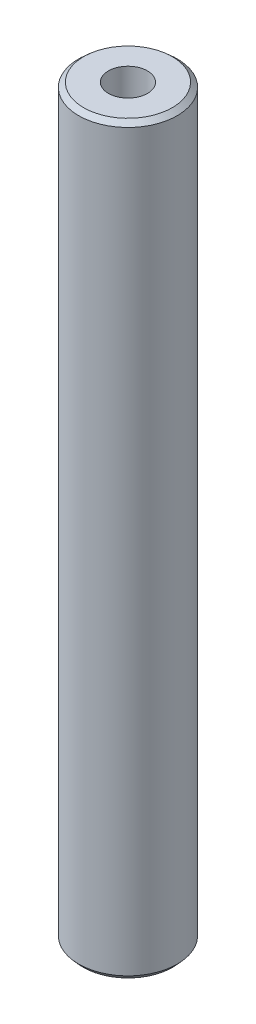
ISO-10303-21;
HEADER;
FILE_DESCRIPTION(('STEP AP214'),'2;1');
FILE_NAME('part.step','',(''),(''),'','','');
FILE_SCHEMA(('AUTOMOTIVE_DESIGN { 1 0 10303 214 1 1 1 1 }'));
ENDSEC;
DATA;
#1=APPLICATION_CONTEXT('core data for automotive mechanical design processes');
#2=APPLICATION_PROTOCOL_DEFINITION('international standard','automotive_design',2000,#1);
#3=PRODUCT_CONTEXT('',#1,'mechanical');
#4=PRODUCT('Part','Part','',(#3));
#5=PRODUCT_RELATED_PRODUCT_CATEGORY('part','',(#4));
#6=PRODUCT_DEFINITION_FORMATION('','',#4);
#7=PRODUCT_DEFINITION_CONTEXT('part definition',#1,'design');
#8=PRODUCT_DEFINITION('design','',#6,#7);
#9=PRODUCT_DEFINITION_SHAPE('','',#8);
#10=(LENGTH_UNIT() NAMED_UNIT(*) SI_UNIT(.MILLI.,.METRE.));
#11=(NAMED_UNIT(*) PLANE_ANGLE_UNIT() SI_UNIT($,.RADIAN.));
#12=(NAMED_UNIT(*) SI_UNIT($,.STERADIAN.) SOLID_ANGLE_UNIT());
#13=UNCERTAINTY_MEASURE_WITH_UNIT(LENGTH_MEASURE(1.E-05),#10,'distance_accuracy_value','');
#14=(GEOMETRIC_REPRESENTATION_CONTEXT(3) GLOBAL_UNCERTAINTY_ASSIGNED_CONTEXT((#13)) GLOBAL_UNIT_ASSIGNED_CONTEXT((#10,
#11,#12)) REPRESENTATION_CONTEXT('',''));
#15=CARTESIAN_POINT('',(0.,0.,0.));
#16=DIRECTION('',(0.,0.,1.));
#17=DIRECTION('',(1.,0.,0.));
#18=AXIS2_PLACEMENT_3D('',#15,#16,#17);
#19=CARTESIAN_POINT('',(0.,453.148733106745,0.));
#20=DIRECTION('',(0.,-1.,0.));
#21=DIRECTION('',(0.,0.,-1.));
#22=AXIS2_PLACEMENT_3D('',#19,#20,#21);
#23=CYLINDRICAL_SURFACE('',#22,30.);
#24=CARTESIAN_POINT('',(0.,450.448071820413,0.));
#25=DIRECTION('',(0.,1.,0.));
#26=DIRECTION('',(0.,0.,1.));
#27=AXIS2_PLACEMENT_3D('',#24,#25,#26);
#28=CIRCLE('',#27,30.);
#29=CARTESIAN_POINT('',(0.,450.448071820413,30.));
#30=VERTEX_POINT('',#29);
#31=EDGE_CURVE('E50',#30,#30,#28,.F.);
#32=ORIENTED_EDGE('',*,*,#31,.T.);
#33=EDGE_LOOP('',(#32));
#34=FACE_BOUND('',#33,.T.);
#35=CARTESIAN_POINT('',(0.,3.03761385038365,0.));
#36=DIRECTION('',(0.,1.,0.));
#37=DIRECTION('',(0.,0.,1.));
#38=AXIS2_PLACEMENT_3D('',#35,#36,#37);
#39=CIRCLE('',#38,30.);
#40=CARTESIAN_POINT('',(0.,3.03761385038365,30.));
#41=VERTEX_POINT('',#40);
#42=EDGE_CURVE('E51',#41,#41,#39,.T.);
#43=ORIENTED_EDGE('',*,*,#42,.T.);
#44=EDGE_LOOP('',(#43));
#45=FACE_BOUND('',#44,.T.);
#46=ADVANCED_FACE('F39',(#34,#45),#23,.T.);
#47=CARTESIAN_POINT('',(0.,453.148733106745,0.));
#48=DIRECTION('',(0.,1.,0.));
#49=DIRECTION('',(0.,0.,1.));
#50=AXIS2_PLACEMENT_3D('',#47,#48,#49);
#51=PLANE('',#50);
#52=CARTESIAN_POINT('',(0.,453.148733106745,0.));
#53=DIRECTION('',(0.,1.,0.));
#54=DIRECTION('',(0.,0.,1.));
#55=AXIS2_PLACEMENT_3D('',#52,#53,#54);
#56=CIRCLE('',#55,26.9623861496163);
#57=CARTESIAN_POINT('',(0.,453.148733106745,26.9623861496163));
#58=VERTEX_POINT('',#57);
#59=EDGE_CURVE('E54',#58,#58,#56,.T.);
#60=ORIENTED_EDGE('',*,*,#59,.T.);
#61=EDGE_LOOP('',(#60));
#62=FACE_BOUND('',#61,.T.);
#63=CARTESIAN_POINT('',(0.,453.148733106745,0.));
#64=DIRECTION('',(0.,1.,0.));
#65=DIRECTION('',(0.,0.,1.));
#66=AXIS2_PLACEMENT_3D('',#63,#64,#65);
#67=CIRCLE('',#66,11.8984008496537);
#68=CARTESIAN_POINT('',(0.,453.148733106745,11.8984008496537));
#69=VERTEX_POINT('',#68);
#70=EDGE_CURVE('E58',#69,#69,#67,.T.);
#71=ORIENTED_EDGE('',*,*,#70,.F.);
#72=EDGE_LOOP('',(#71));
#73=FACE_BOUND('',#72,.T.);
#74=ADVANCED_FACE('F69',(#62,#73),#51,.T.);
#75=CARTESIAN_POINT('',(0.,0.,0.));
#76=DIRECTION('',(0.,1.,0.));
#77=DIRECTION('',(0.,0.,1.));
#78=AXIS2_PLACEMENT_3D('',#75,#76,#77);
#79=PLANE('',#78);
#80=CARTESIAN_POINT('',(0.,0.,0.));
#81=DIRECTION('',(0.,1.,0.));
#82=DIRECTION('',(0.,0.,1.));
#83=AXIS2_PLACEMENT_3D('',#80,#81,#82);
#84=CIRCLE('',#83,27.2993387136682);
#85=CARTESIAN_POINT('',(0.,0.,27.2993387136682));
#86=VERTEX_POINT('',#85);
#87=EDGE_CURVE('E10',#86,#86,#84,.F.);
#88=ORIENTED_EDGE('',*,*,#87,.T.);
#89=EDGE_LOOP('',(#88));
#90=FACE_BOUND('',#89,.T.);
#91=CARTESIAN_POINT('',(0.,0.,0.));
#92=DIRECTION('',(0.,1.,0.));
#93=DIRECTION('',(0.,0.,1.));
#94=AXIS2_PLACEMENT_3D('',#91,#92,#93);
#95=CIRCLE('',#94,11.8984008496537);
#96=CARTESIAN_POINT('',(0.,0.,11.8984008496537));
#97=VERTEX_POINT('',#96);
#98=EDGE_CURVE('E63',#97,#97,#95,.T.);
#99=ORIENTED_EDGE('',*,*,#98,.T.);
#100=EDGE_LOOP('',(#99));
#101=FACE_BOUND('',#100,.T.);
#102=ADVANCED_FACE('F75',(#90,#101),#79,.F.);
#103=CARTESIAN_POINT('',(0.,453.148733106745,0.));
#104=DIRECTION('',(0.,-1.,0.));
#105=DIRECTION('',(0.,0.,-1.));
#106=AXIS2_PLACEMENT_3D('',#103,#104,#105);
#107=CYLINDRICAL_SURFACE('',#106,11.8984008496537);
#108=ORIENTED_EDGE('',*,*,#70,.T.);
#109=EDGE_LOOP('',(#108));
#110=FACE_BOUND('',#109,.T.);
#111=ORIENTED_EDGE('',*,*,#98,.F.);
#112=EDGE_LOOP('',(#111));
#113=FACE_BOUND('',#112,.T.);
#114=ADVANCED_FACE('F70',(#110,#113),#107,.F.);
#115=CARTESIAN_POINT('',(0.,453.148733106745,0.));
#116=DIRECTION('',(0.,-1.,0.));
#117=DIRECTION('',(0.,0.,-1.));
#118=AXIS2_PLACEMENT_3D('',#115,#116,#117);
#119=CONICAL_SURFACE('',#118,26.9623861496163,0.844050995083463);
#120=ORIENTED_EDGE('',*,*,#31,.F.);
#121=EDGE_LOOP('',(#120));
#122=FACE_BOUND('',#121,.T.);
#123=ORIENTED_EDGE('',*,*,#59,.F.);
#124=EDGE_LOOP('',(#123));
#125=FACE_BOUND('',#124,.T.);
#126=ADVANCED_FACE('F81',(#122,#125),#119,.T.);
#127=CARTESIAN_POINT('',(0.,3.03761385038365,0.));
#128=DIRECTION('',(0.,1.,0.));
#129=DIRECTION('',(0.,0.,1.));
#130=AXIS2_PLACEMENT_3D('',#127,#128,#129);
#131=CONICAL_SURFACE('',#130,30.,0.726745331711441);
#132=ORIENTED_EDGE('',*,*,#87,.F.);
#133=EDGE_LOOP('',(#132));
#134=FACE_BOUND('',#133,.T.);
#135=ORIENTED_EDGE('',*,*,#42,.F.);
#136=EDGE_LOOP('',(#135));
#137=FACE_BOUND('',#136,.T.);
#138=ADVANCED_FACE('F45',(#134,#137),#131,.T.);
#139=CLOSED_SHELL('',(#46,#74,#102,#114,#126,#138));
#140=MANIFOLD_SOLID_BREP('B2',#139);
#141=ADVANCED_BREP_SHAPE_REPRESENTATION('',(#18,#140),#14);
#142=SHAPE_DEFINITION_REPRESENTATION(#9,#141);
ENDSEC;
END-ISO-10303-21;
